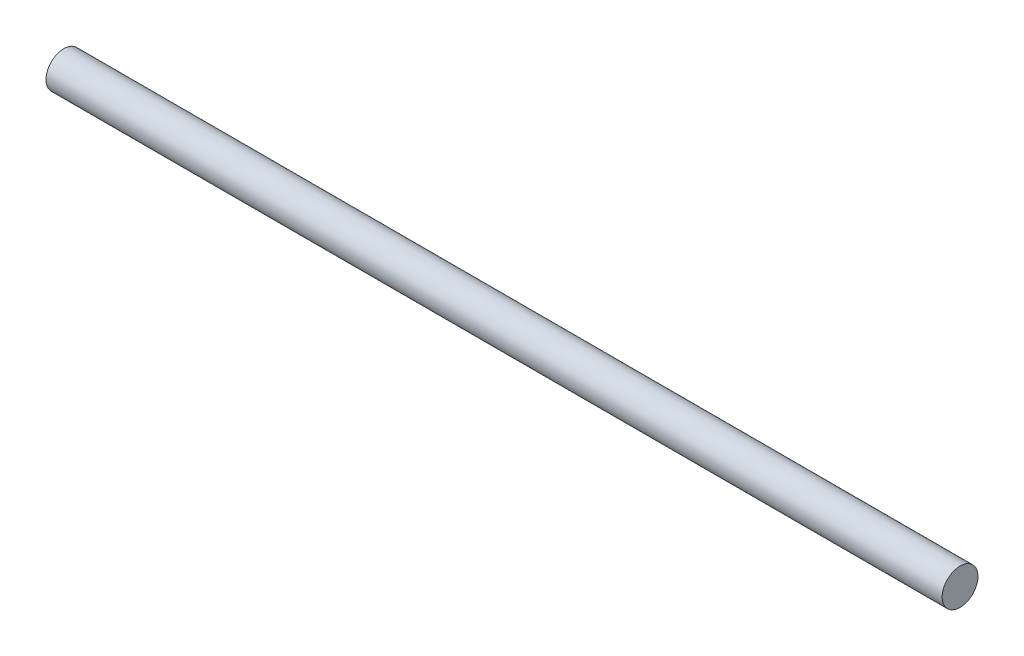
ISO-10303-21;
HEADER;
FILE_DESCRIPTION(('STEP AP214'),'2;1');
FILE_NAME('part.step','',(''),(''),'','','');
FILE_SCHEMA(('AUTOMOTIVE_DESIGN { 1 0 10303 214 1 1 1 1 }'));
ENDSEC;
DATA;
#1=APPLICATION_CONTEXT('core data for automotive mechanical design processes');
#2=APPLICATION_PROTOCOL_DEFINITION('international standard','automotive_design',2000,#1);
#3=PRODUCT_CONTEXT('',#1,'mechanical');
#4=PRODUCT('Part','Part','',(#3));
#5=PRODUCT_RELATED_PRODUCT_CATEGORY('part','',(#4));
#6=PRODUCT_DEFINITION_FORMATION('','',#4);
#7=PRODUCT_DEFINITION_CONTEXT('part definition',#1,'design');
#8=PRODUCT_DEFINITION('design','',#6,#7);
#9=PRODUCT_DEFINITION_SHAPE('','',#8);
#10=(LENGTH_UNIT() NAMED_UNIT(*) SI_UNIT(.MILLI.,.METRE.));
#11=(NAMED_UNIT(*) PLANE_ANGLE_UNIT() SI_UNIT($,.RADIAN.));
#12=(NAMED_UNIT(*) SI_UNIT($,.STERADIAN.) SOLID_ANGLE_UNIT());
#13=UNCERTAINTY_MEASURE_WITH_UNIT(LENGTH_MEASURE(1.E-05),#10,'distance_accuracy_value','');
#14=(GEOMETRIC_REPRESENTATION_CONTEXT(3) GLOBAL_UNCERTAINTY_ASSIGNED_CONTEXT((#13)) GLOBAL_UNIT_ASSIGNED_CONTEXT((#10,
#11,#12)) REPRESENTATION_CONTEXT('',''));
#15=CARTESIAN_POINT('',(0.,0.,0.));
#16=DIRECTION('',(0.,0.,1.));
#17=DIRECTION('',(1.,0.,0.));
#18=AXIS2_PLACEMENT_3D('',#15,#16,#17);
#19=CARTESIAN_POINT('',(250.,0.,0.));
#20=DIRECTION('',(-1.,0.,0.));
#21=DIRECTION('',(0.,0.,1.));
#22=AXIS2_PLACEMENT_3D('',#19,#20,#21);
#23=CYLINDRICAL_SURFACE('',#22,5.);
#24=CARTESIAN_POINT('',(250.,0.,0.));
#25=DIRECTION('',(1.,0.,0.));
#26=DIRECTION('',(0.,0.,-1.));
#27=AXIS2_PLACEMENT_3D('',#24,#25,#26);
#28=CIRCLE('',#27,5.);
#29=CARTESIAN_POINT('',(250.,0.,-5.));
#30=VERTEX_POINT('',#29);
#31=EDGE_CURVE('E10',#30,#30,#28,.T.);
#32=ORIENTED_EDGE('',*,*,#31,.F.);
#33=EDGE_LOOP('',(#32));
#34=FACE_BOUND('',#33,.T.);
#35=CARTESIAN_POINT('',(0.,0.,0.));
#36=DIRECTION('',(1.,0.,0.));
#37=DIRECTION('',(0.,0.,-1.));
#38=AXIS2_PLACEMENT_3D('',#35,#36,#37);
#39=CIRCLE('',#38,5.);
#40=CARTESIAN_POINT('',(0.,0.,-5.));
#41=VERTEX_POINT('',#40);
#42=EDGE_CURVE('E44',#41,#41,#39,.T.);
#43=ORIENTED_EDGE('',*,*,#42,.T.);
#44=EDGE_LOOP('',(#43));
#45=FACE_BOUND('',#44,.T.);
#46=ADVANCED_FACE('F41',(#34,#45),#23,.T.);
#47=CARTESIAN_POINT('',(250.,0.,0.));
#48=DIRECTION('',(1.,0.,0.));
#49=DIRECTION('',(0.,0.,-1.));
#50=AXIS2_PLACEMENT_3D('',#47,#48,#49);
#51=PLANE('',#50);
#52=ORIENTED_EDGE('',*,*,#31,.T.);
#53=EDGE_LOOP('',(#52));
#54=FACE_BOUND('',#53,.T.);
#55=ADVANCED_FACE('F58',(#54),#51,.T.);
#56=CARTESIAN_POINT('',(0.,0.,0.));
#57=DIRECTION('',(1.,0.,0.));
#58=DIRECTION('',(0.,0.,-1.));
#59=AXIS2_PLACEMENT_3D('',#56,#57,#58);
#60=PLANE('',#59);
#61=ORIENTED_EDGE('',*,*,#42,.F.);
#62=EDGE_LOOP('',(#61));
#63=FACE_BOUND('',#62,.T.);
#64=ADVANCED_FACE('F56',(#63),#60,.F.);
#65=CLOSED_SHELL('',(#46,#55,#64));
#66=MANIFOLD_SOLID_BREP('B2',#65);
#67=ADVANCED_BREP_SHAPE_REPRESENTATION('',(#18,#66),#14);
#68=SHAPE_DEFINITION_REPRESENTATION(#9,#67);
ENDSEC;
END-ISO-10303-21;
